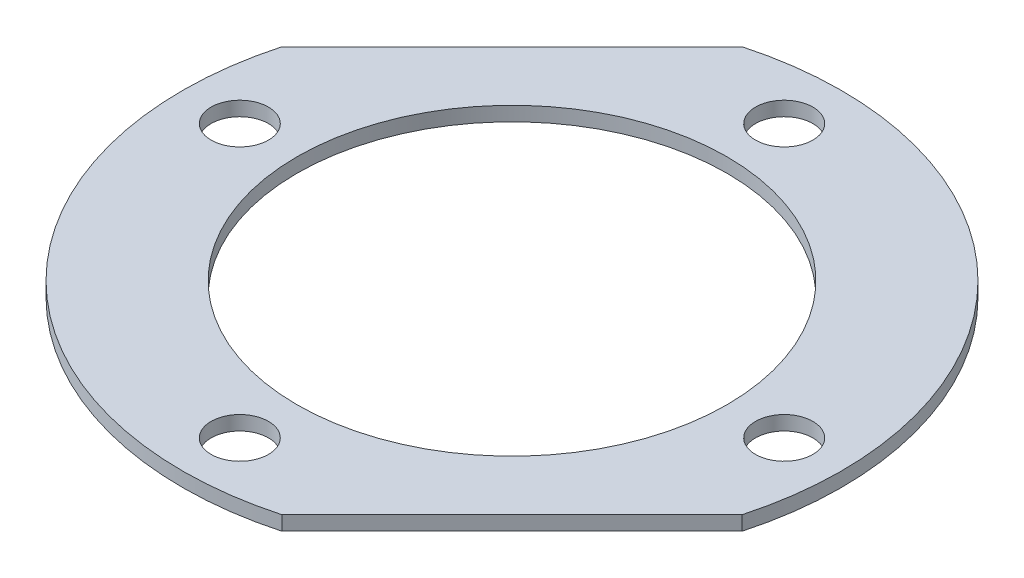
ISO-10303-21;
HEADER;
FILE_DESCRIPTION(('STEP AP214'),'2;1');
FILE_NAME('part.step','',(''),(''),'','','');
FILE_SCHEMA(('AUTOMOTIVE_DESIGN { 1 0 10303 214 1 1 1 1 }'));
ENDSEC;
DATA;
#1=APPLICATION_CONTEXT('core data for automotive mechanical design processes');
#2=APPLICATION_PROTOCOL_DEFINITION('international standard','automotive_design',2000,#1);
#3=PRODUCT_CONTEXT('',#1,'mechanical');
#4=PRODUCT('Part','Part','',(#3));
#5=PRODUCT_RELATED_PRODUCT_CATEGORY('part','',(#4));
#6=PRODUCT_DEFINITION_FORMATION('','',#4);
#7=PRODUCT_DEFINITION_CONTEXT('part definition',#1,'design');
#8=PRODUCT_DEFINITION('design','',#6,#7);
#9=PRODUCT_DEFINITION_SHAPE('','',#8);
#10=(LENGTH_UNIT() NAMED_UNIT(*) SI_UNIT(.MILLI.,.METRE.));
#11=(NAMED_UNIT(*) PLANE_ANGLE_UNIT() SI_UNIT($,.RADIAN.));
#12=(NAMED_UNIT(*) SI_UNIT($,.STERADIAN.) SOLID_ANGLE_UNIT());
#13=UNCERTAINTY_MEASURE_WITH_UNIT(LENGTH_MEASURE(1.E-05),#10,'distance_accuracy_value','');
#14=(GEOMETRIC_REPRESENTATION_CONTEXT(3) GLOBAL_UNCERTAINTY_ASSIGNED_CONTEXT((#13)) GLOBAL_UNIT_ASSIGNED_CONTEXT((#10,
#11,#12)) REPRESENTATION_CONTEXT('',''));
#15=CARTESIAN_POINT('',(0.,0.,0.));
#16=DIRECTION('',(0.,0.,1.));
#17=DIRECTION('',(1.,0.,0.));
#18=AXIS2_PLACEMENT_3D('',#15,#16,#17);
#19=CARTESIAN_POINT('',(14.142135623731,1.,14.1421356237309));
#20=DIRECTION('',(-0.707106781186548,0.,-0.707106781186547));
#21=DIRECTION('',(-0.707106781186547,0.,0.707106781186548));
#22=AXIS2_PLACEMENT_3D('',#19,#20,#21);
#23=PLANE('',#22);
#24=DIRECTION('',(0.707106781186547,0.,-0.707106781186548));
#25=VECTOR('',#24,1.);
#26=CARTESIAN_POINT('',(14.142135623731,0.,14.1421356237309));
#27=LINE('',#26,#25);
#28=CARTESIAN_POINT('',(6.11094642162644,0.,22.1733248258355));
#29=VERTEX_POINT('',#28);
#30=CARTESIAN_POINT('',(22.1733248258355,0.,6.11094642162639));
#31=VERTEX_POINT('',#30);
#32=EDGE_CURVE('E133',#29,#31,#27,.T.);
#33=ORIENTED_EDGE('',*,*,#32,.T.);
#34=DIRECTION('',(0.,-1.,0.));
#35=VECTOR('',#34,1.);
#36=CARTESIAN_POINT('',(22.1733248258355,1.,6.11094642162639));
#37=LINE('',#36,#35);
#38=CARTESIAN_POINT('',(22.1733248258355,1.,6.11094642162639));
#39=VERTEX_POINT('',#38);
#40=EDGE_CURVE('E11',#39,#31,#37,.T.);
#41=ORIENTED_EDGE('',*,*,#40,.F.);
#42=DIRECTION('',(0.707106781186547,0.,-0.707106781186548));
#43=VECTOR('',#42,1.);
#44=CARTESIAN_POINT('',(14.142135623731,1.,14.1421356237309));
#45=LINE('',#44,#43);
#46=CARTESIAN_POINT('',(6.11094642162644,1.,22.1733248258355));
#47=VERTEX_POINT('',#46);
#48=EDGE_CURVE('E98',#47,#39,#45,.T.);
#49=ORIENTED_EDGE('',*,*,#48,.F.);
#50=DIRECTION('',(0.,-1.,0.));
#51=VECTOR('',#50,1.);
#52=CARTESIAN_POINT('',(6.11094642162644,1.,22.1733248258355));
#53=LINE('',#52,#51);
#54=EDGE_CURVE('E132',#47,#29,#53,.T.);
#55=ORIENTED_EDGE('',*,*,#54,.T.);
#56=EDGE_LOOP('',(#33,#41,#49,#55));
#57=FACE_BOUND('',#56,.T.);
#58=ADVANCED_FACE('F45',(#57),#23,.F.);
#59=CARTESIAN_POINT('',(0.,1.,0.));
#60=DIRECTION('',(0.,-1.,0.));
#61=DIRECTION('',(0.,0.,-1.));
#62=AXIS2_PLACEMENT_3D('',#59,#60,#61);
#63=CYLINDRICAL_SURFACE('',#62,23.);
#64=CARTESIAN_POINT('',(0.,0.,0.));
#65=DIRECTION('',(0.,1.,0.));
#66=DIRECTION('',(0.,0.,1.));
#67=AXIS2_PLACEMENT_3D('',#64,#65,#66);
#68=CIRCLE('',#67,23.);
#69=CARTESIAN_POINT('',(-6.11094642162644,0.,-22.1733248258355));
#70=VERTEX_POINT('',#69);
#71=EDGE_CURVE('E103',#31,#70,#68,.T.);
#72=ORIENTED_EDGE('',*,*,#71,.T.);
#73=DIRECTION('',(0.,-1.,0.));
#74=VECTOR('',#73,1.);
#75=CARTESIAN_POINT('',(-6.11094642162644,1.,-22.1733248258355));
#76=LINE('',#75,#74);
#77=CARTESIAN_POINT('',(-6.11094642162644,1.,-22.1733248258355));
#78=VERTEX_POINT('',#77);
#79=EDGE_CURVE('E54',#78,#70,#76,.T.);
#80=ORIENTED_EDGE('',*,*,#79,.F.);
#81=CARTESIAN_POINT('',(0.,1.,0.));
#82=DIRECTION('',(0.,1.,0.));
#83=DIRECTION('',(0.,0.,1.));
#84=AXIS2_PLACEMENT_3D('',#81,#82,#83);
#85=CIRCLE('',#84,23.);
#86=EDGE_CURVE('E92',#39,#78,#85,.T.);
#87=ORIENTED_EDGE('',*,*,#86,.F.);
#88=ORIENTED_EDGE('',*,*,#40,.T.);
#89=EDGE_LOOP('',(#72,#80,#87,#88));
#90=FACE_BOUND('',#89,.T.);
#91=ADVANCED_FACE('F102',(#90),#63,.T.);
#92=CARTESIAN_POINT('',(-14.142135623731,1.,-14.1421356237309));
#93=DIRECTION('',(0.707106781186548,0.,0.707106781186547));
#94=DIRECTION('',(0.707106781186547,0.,-0.707106781186548));
#95=AXIS2_PLACEMENT_3D('',#92,#93,#94);
#96=PLANE('',#95);
#97=DIRECTION('',(-0.707106781186547,0.,0.707106781186548));
#98=VECTOR('',#97,1.);
#99=CARTESIAN_POINT('',(-14.142135623731,0.,-14.1421356237309));
#100=LINE('',#99,#98);
#101=CARTESIAN_POINT('',(-22.1733248258355,0.,-6.11094642162644));
#102=VERTEX_POINT('',#101);
#103=EDGE_CURVE('E79',#70,#102,#100,.T.);
#104=ORIENTED_EDGE('',*,*,#103,.T.);
#105=DIRECTION('',(0.,-1.,0.));
#106=VECTOR('',#105,1.);
#107=CARTESIAN_POINT('',(-22.1733248258355,1.,-6.11094642162644));
#108=LINE('',#107,#106);
#109=CARTESIAN_POINT('',(-22.1733248258355,1.,-6.11094642162644));
#110=VERTEX_POINT('',#109);
#111=EDGE_CURVE('E105',#110,#102,#108,.T.);
#112=ORIENTED_EDGE('',*,*,#111,.F.);
#113=DIRECTION('',(-0.707106781186547,0.,0.707106781186548));
#114=VECTOR('',#113,1.);
#115=CARTESIAN_POINT('',(-14.142135623731,1.,-14.1421356237309));
#116=LINE('',#115,#114);
#117=EDGE_CURVE('E96',#78,#110,#116,.T.);
#118=ORIENTED_EDGE('',*,*,#117,.F.);
#119=ORIENTED_EDGE('',*,*,#79,.T.);
#120=EDGE_LOOP('',(#104,#112,#118,#119));
#121=FACE_BOUND('',#120,.T.);
#122=ADVANCED_FACE('F106',(#121),#96,.F.);
#123=CARTESIAN_POINT('',(19.,1.,0.));
#124=DIRECTION('',(0.,-1.,0.));
#125=DIRECTION('',(0.,0.,-1.));
#126=AXIS2_PLACEMENT_3D('',#123,#124,#125);
#127=CYLINDRICAL_SURFACE('',#126,2.);
#128=CARTESIAN_POINT('',(19.,1.,0.));
#129=DIRECTION('',(0.,1.,0.));
#130=DIRECTION('',(0.,0.,1.));
#131=AXIS2_PLACEMENT_3D('',#128,#129,#130);
#132=CIRCLE('',#131,2.);
#133=CARTESIAN_POINT('',(19.,1.,2.));
#134=VERTEX_POINT('',#133);
#135=EDGE_CURVE('E124',#134,#134,#132,.T.);
#136=ORIENTED_EDGE('',*,*,#135,.T.);
#137=EDGE_LOOP('',(#136));
#138=FACE_BOUND('',#137,.T.);
#139=CARTESIAN_POINT('',(19.,0.,0.));
#140=DIRECTION('',(0.,1.,0.));
#141=DIRECTION('',(0.,0.,1.));
#142=AXIS2_PLACEMENT_3D('',#139,#140,#141);
#143=CIRCLE('',#142,2.);
#144=CARTESIAN_POINT('',(19.,0.,2.));
#145=VERTEX_POINT('',#144);
#146=EDGE_CURVE('E153',#145,#145,#143,.T.);
#147=ORIENTED_EDGE('',*,*,#146,.F.);
#148=EDGE_LOOP('',(#147));
#149=FACE_BOUND('',#148,.T.);
#150=ADVANCED_FACE('F180',(#138,#149),#127,.F.);
#151=CARTESIAN_POINT('',(0.,1.,0.));
#152=DIRECTION('',(0.,-1.,0.));
#153=DIRECTION('',(0.,0.,-1.));
#154=AXIS2_PLACEMENT_3D('',#151,#152,#153);
#155=CYLINDRICAL_SURFACE('',#154,15.);
#156=CARTESIAN_POINT('',(0.,1.,0.));
#157=DIRECTION('',(0.,1.,0.));
#158=DIRECTION('',(0.,0.,1.));
#159=AXIS2_PLACEMENT_3D('',#156,#157,#158);
#160=CIRCLE('',#159,15.);
#161=CARTESIAN_POINT('',(0.,1.,15.));
#162=VERTEX_POINT('',#161);
#163=EDGE_CURVE('E120',#162,#162,#160,.T.);
#164=ORIENTED_EDGE('',*,*,#163,.T.);
#165=EDGE_LOOP('',(#164));
#166=FACE_BOUND('',#165,.T.);
#167=CARTESIAN_POINT('',(0.,0.,0.));
#168=DIRECTION('',(0.,1.,0.));
#169=DIRECTION('',(0.,0.,1.));
#170=AXIS2_PLACEMENT_3D('',#167,#168,#169);
#171=CIRCLE('',#170,15.);
#172=CARTESIAN_POINT('',(0.,0.,15.));
#173=VERTEX_POINT('',#172);
#174=EDGE_CURVE('E149',#173,#173,#171,.T.);
#175=ORIENTED_EDGE('',*,*,#174,.F.);
#176=EDGE_LOOP('',(#175));
#177=FACE_BOUND('',#176,.T.);
#178=ADVANCED_FACE('F196',(#166,#177),#155,.F.);
#179=CARTESIAN_POINT('',(0.,1.,-19.));
#180=DIRECTION('',(0.,-1.,0.));
#181=DIRECTION('',(0.,0.,-1.));
#182=AXIS2_PLACEMENT_3D('',#179,#180,#181);
#183=CYLINDRICAL_SURFACE('',#182,2.);
#184=CARTESIAN_POINT('',(0.,1.,-19.));
#185=DIRECTION('',(0.,1.,0.));
#186=DIRECTION('',(0.,0.,1.));
#187=AXIS2_PLACEMENT_3D('',#184,#185,#186);
#188=CIRCLE('',#187,2.);
#189=CARTESIAN_POINT('',(0.,1.,-17.));
#190=VERTEX_POINT('',#189);
#191=EDGE_CURVE('E116',#190,#190,#188,.T.);
#192=ORIENTED_EDGE('',*,*,#191,.T.);
#193=EDGE_LOOP('',(#192));
#194=FACE_BOUND('',#193,.T.);
#195=CARTESIAN_POINT('',(0.,0.,-19.));
#196=DIRECTION('',(0.,1.,0.));
#197=DIRECTION('',(0.,0.,1.));
#198=AXIS2_PLACEMENT_3D('',#195,#196,#197);
#199=CIRCLE('',#198,2.);
#200=CARTESIAN_POINT('',(0.,0.,-17.));
#201=VERTEX_POINT('',#200);
#202=EDGE_CURVE('E145',#201,#201,#199,.T.);
#203=ORIENTED_EDGE('',*,*,#202,.F.);
#204=EDGE_LOOP('',(#203));
#205=FACE_BOUND('',#204,.T.);
#206=ADVANCED_FACE('F191',(#194,#205),#183,.F.);
#207=CARTESIAN_POINT('',(-19.,1.,0.));
#208=DIRECTION('',(0.,-1.,0.));
#209=DIRECTION('',(0.,0.,-1.));
#210=AXIS2_PLACEMENT_3D('',#207,#208,#209);
#211=CYLINDRICAL_SURFACE('',#210,2.);
#212=CARTESIAN_POINT('',(-19.,1.,0.));
#213=DIRECTION('',(0.,1.,0.));
#214=DIRECTION('',(0.,0.,1.));
#215=AXIS2_PLACEMENT_3D('',#212,#213,#214);
#216=CIRCLE('',#215,2.);
#217=CARTESIAN_POINT('',(-19.,1.,2.));
#218=VERTEX_POINT('',#217);
#219=EDGE_CURVE('E110',#218,#218,#216,.T.);
#220=ORIENTED_EDGE('',*,*,#219,.T.);
#221=EDGE_LOOP('',(#220));
#222=FACE_BOUND('',#221,.T.);
#223=CARTESIAN_POINT('',(-19.,0.,0.));
#224=DIRECTION('',(0.,1.,0.));
#225=DIRECTION('',(0.,0.,1.));
#226=AXIS2_PLACEMENT_3D('',#223,#224,#225);
#227=CIRCLE('',#226,2.);
#228=CARTESIAN_POINT('',(-19.,0.,2.));
#229=VERTEX_POINT('',#228);
#230=EDGE_CURVE('E141',#229,#229,#227,.T.);
#231=ORIENTED_EDGE('',*,*,#230,.F.);
#232=EDGE_LOOP('',(#231));
#233=FACE_BOUND('',#232,.T.);
#234=ADVANCED_FACE('F184',(#222,#233),#211,.F.);
#235=EDGE_CURVE('E85',#102,#29,#68,.T.);
#236=ORIENTED_EDGE('',*,*,#235,.T.);
#237=ORIENTED_EDGE('',*,*,#54,.F.);
#238=EDGE_CURVE('E62',#110,#47,#85,.T.);
#239=ORIENTED_EDGE('',*,*,#238,.F.);
#240=ORIENTED_EDGE('',*,*,#111,.T.);
#241=EDGE_LOOP('',(#236,#237,#239,#240));
#242=FACE_BOUND('',#241,.T.);
#243=ADVANCED_FACE('F164',(#242),#63,.T.);
#244=CARTESIAN_POINT('',(0.,1.,19.));
#245=DIRECTION('',(0.,-1.,0.));
#246=DIRECTION('',(0.,0.,-1.));
#247=AXIS2_PLACEMENT_3D('',#244,#245,#246);
#248=CYLINDRICAL_SURFACE('',#247,2.);
#249=CARTESIAN_POINT('',(0.,1.,19.));
#250=DIRECTION('',(0.,1.,0.));
#251=DIRECTION('',(0.,0.,1.));
#252=AXIS2_PLACEMENT_3D('',#249,#250,#251);
#253=CIRCLE('',#252,2.);
#254=CARTESIAN_POINT('',(0.,1.,21.));
#255=VERTEX_POINT('',#254);
#256=EDGE_CURVE('E128',#255,#255,#253,.T.);
#257=ORIENTED_EDGE('',*,*,#256,.T.);
#258=EDGE_LOOP('',(#257));
#259=FACE_BOUND('',#258,.T.);
#260=CARTESIAN_POINT('',(0.,0.,19.));
#261=DIRECTION('',(0.,1.,0.));
#262=DIRECTION('',(0.,0.,1.));
#263=AXIS2_PLACEMENT_3D('',#260,#261,#262);
#264=CIRCLE('',#263,2.);
#265=CARTESIAN_POINT('',(0.,0.,21.));
#266=VERTEX_POINT('',#265);
#267=EDGE_CURVE('E157',#266,#266,#264,.T.);
#268=ORIENTED_EDGE('',*,*,#267,.F.);
#269=EDGE_LOOP('',(#268));
#270=FACE_BOUND('',#269,.T.);
#271=ADVANCED_FACE('F183',(#259,#270),#248,.F.);
#272=CARTESIAN_POINT('',(0.,1.,0.));
#273=DIRECTION('',(0.,1.,0.));
#274=DIRECTION('',(0.,0.,1.));
#275=AXIS2_PLACEMENT_3D('',#272,#273,#274);
#276=PLANE('',#275);
#277=ORIENTED_EDGE('',*,*,#48,.T.);
#278=ORIENTED_EDGE('',*,*,#86,.T.);
#279=ORIENTED_EDGE('',*,*,#117,.T.);
#280=ORIENTED_EDGE('',*,*,#238,.T.);
#281=EDGE_LOOP('',(#277,#278,#279,#280));
#282=FACE_BOUND('',#281,.T.);
#283=ORIENTED_EDGE('',*,*,#219,.F.);
#284=EDGE_LOOP('',(#283));
#285=FACE_BOUND('',#284,.T.);
#286=ORIENTED_EDGE('',*,*,#191,.F.);
#287=EDGE_LOOP('',(#286));
#288=FACE_BOUND('',#287,.T.);
#289=ORIENTED_EDGE('',*,*,#163,.F.);
#290=EDGE_LOOP('',(#289));
#291=FACE_BOUND('',#290,.T.);
#292=ORIENTED_EDGE('',*,*,#135,.F.);
#293=EDGE_LOOP('',(#292));
#294=FACE_BOUND('',#293,.T.);
#295=ORIENTED_EDGE('',*,*,#256,.F.);
#296=EDGE_LOOP('',(#295));
#297=FACE_BOUND('',#296,.T.);
#298=ADVANCED_FACE('F93',(#282,#285,#288,#291,#294,#297),#276,.T.);
#299=CARTESIAN_POINT('',(0.,0.,0.));
#300=DIRECTION('',(0.,1.,0.));
#301=DIRECTION('',(0.,0.,1.));
#302=AXIS2_PLACEMENT_3D('',#299,#300,#301);
#303=PLANE('',#302);
#304=ORIENTED_EDGE('',*,*,#32,.F.);
#305=ORIENTED_EDGE('',*,*,#235,.F.);
#306=ORIENTED_EDGE('',*,*,#103,.F.);
#307=ORIENTED_EDGE('',*,*,#71,.F.);
#308=EDGE_LOOP('',(#304,#305,#306,#307));
#309=FACE_BOUND('',#308,.T.);
#310=ORIENTED_EDGE('',*,*,#230,.T.);
#311=EDGE_LOOP('',(#310));
#312=FACE_BOUND('',#311,.T.);
#313=ORIENTED_EDGE('',*,*,#202,.T.);
#314=EDGE_LOOP('',(#313));
#315=FACE_BOUND('',#314,.T.);
#316=ORIENTED_EDGE('',*,*,#174,.T.);
#317=EDGE_LOOP('',(#316));
#318=FACE_BOUND('',#317,.T.);
#319=ORIENTED_EDGE('',*,*,#146,.T.);
#320=EDGE_LOOP('',(#319));
#321=FACE_BOUND('',#320,.T.);
#322=ORIENTED_EDGE('',*,*,#267,.T.);
#323=EDGE_LOOP('',(#322));
#324=FACE_BOUND('',#323,.T.);
#325=ADVANCED_FACE('F167',(#309,#312,#315,#318,#321,#324),#303,.F.);
#326=CLOSED_SHELL('',(#58,#91,#122,#150,#178,#206,#234,#243,#271,#298,#325));
#327=MANIFOLD_SOLID_BREP('B2',#326);
#328=ADVANCED_BREP_SHAPE_REPRESENTATION('',(#18,#327),#14);
#329=SHAPE_DEFINITION_REPRESENTATION(#9,#328);
ENDSEC;
END-ISO-10303-21;
